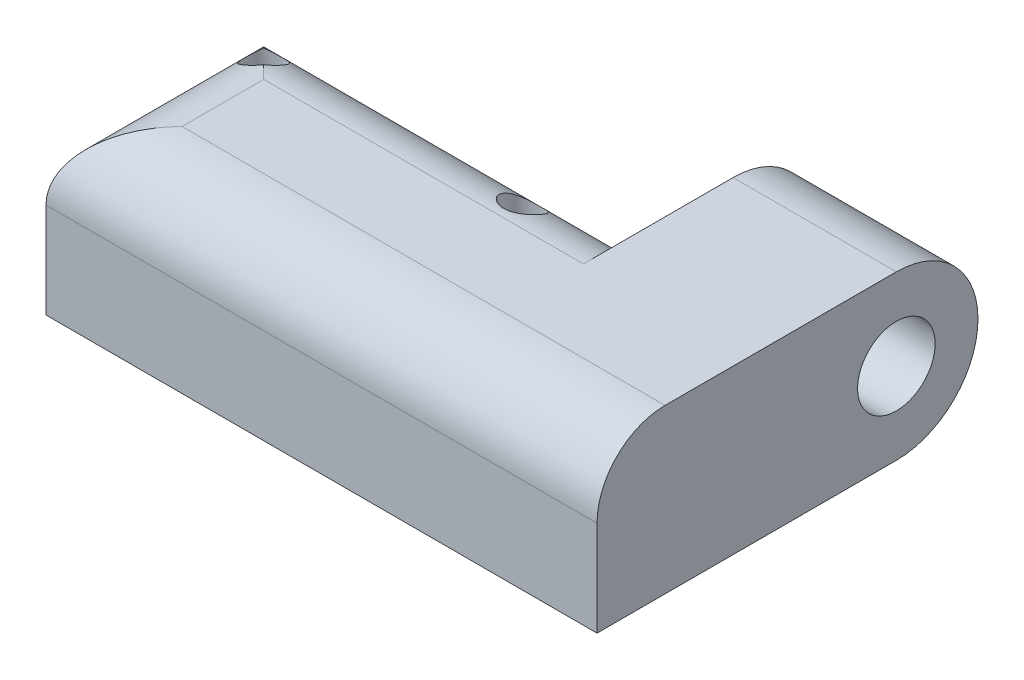
ISO-10303-21;
HEADER;
FILE_DESCRIPTION(('STEP AP214'),'2;1');
FILE_NAME('part.step','',(''),(''),'','','');
FILE_SCHEMA(('AUTOMOTIVE_DESIGN { 1 0 10303 214 1 1 1 1 }'));
ENDSEC;
DATA;
#1=APPLICATION_CONTEXT('core data for automotive mechanical design processes');
#2=APPLICATION_PROTOCOL_DEFINITION('international standard','automotive_design',2000,#1);
#3=PRODUCT_CONTEXT('',#1,'mechanical');
#4=PRODUCT('Part','Part','',(#3));
#5=PRODUCT_RELATED_PRODUCT_CATEGORY('part','',(#4));
#6=PRODUCT_DEFINITION_FORMATION('','',#4);
#7=PRODUCT_DEFINITION_CONTEXT('part definition',#1,'design');
#8=PRODUCT_DEFINITION('design','',#6,#7);
#9=PRODUCT_DEFINITION_SHAPE('','',#8);
#10=(LENGTH_UNIT() NAMED_UNIT(*) SI_UNIT(.MILLI.,.METRE.));
#11=(NAMED_UNIT(*) PLANE_ANGLE_UNIT() SI_UNIT($,.RADIAN.));
#12=(NAMED_UNIT(*) SI_UNIT($,.STERADIAN.) SOLID_ANGLE_UNIT());
#13=UNCERTAINTY_MEASURE_WITH_UNIT(LENGTH_MEASURE(1.E-05),#10,'distance_accuracy_value','');
#14=(GEOMETRIC_REPRESENTATION_CONTEXT(3) GLOBAL_UNCERTAINTY_ASSIGNED_CONTEXT((#13)) GLOBAL_UNIT_ASSIGNED_CONTEXT((#10,
#11,#12)) REPRESENTATION_CONTEXT('',''));
#15=CARTESIAN_POINT('',(0.,0.,0.));
#16=DIRECTION('',(0.,0.,1.));
#17=DIRECTION('',(1.,0.,0.));
#18=AXIS2_PLACEMENT_3D('',#15,#16,#17);
#19=CARTESIAN_POINT('',(1.75,12.,-5.));
#20=DIRECTION('',(0.,-1.,0.));
#21=DIRECTION('',(0.,0.,-1.));
#22=AXIS2_PLACEMENT_3D('',#19,#20,#21);
#23=CYLINDRICAL_SURFACE('',#22,3.);
#24=CARTESIAN_POINT('',(1.75,2.,-5.));
#25=DIRECTION('',(0.,1.,0.));
#26=DIRECTION('',(0.,0.,1.));
#27=AXIS2_PLACEMENT_3D('',#24,#25,#26);
#28=CIRCLE('',#27,3.);
#29=CARTESIAN_POINT('',(-1.07842712474619,2.,-6.));
#30=VERTEX_POINT('',#29);
#31=CARTESIAN_POINT('',(4.57842712474619,2.,-6.));
#32=VERTEX_POINT('',#31);
#33=EDGE_CURVE('E193',#30,#32,#28,.T.);
#34=ORIENTED_EDGE('',*,*,#33,.F.);
#35=DIRECTION('',(0.,-1.,0.));
#36=VECTOR('',#35,1.);
#37=CARTESIAN_POINT('',(-1.07842712474619,12.,-6.));
#38=LINE('',#37,#36);
#39=CARTESIAN_POINT('',(-1.07842712474619,0.,-6.));
#40=VERTEX_POINT('',#39);
#41=EDGE_CURVE('E260',#30,#40,#38,.T.);
#42=ORIENTED_EDGE('',*,*,#41,.T.);
#43=CARTESIAN_POINT('',(1.75,0.,-5.));
#44=DIRECTION('',(0.,1.,0.));
#45=DIRECTION('',(0.,0.,1.));
#46=AXIS2_PLACEMENT_3D('',#43,#44,#45);
#47=CIRCLE('',#46,3.);
#48=CARTESIAN_POINT('',(4.57842712474619,0.,-6.));
#49=VERTEX_POINT('',#48);
#50=EDGE_CURVE('E214',#40,#49,#47,.T.);
#51=ORIENTED_EDGE('',*,*,#50,.T.);
#52=DIRECTION('',(0.,-1.,0.));
#53=VECTOR('',#52,1.);
#54=CARTESIAN_POINT('',(4.57842712474619,12.,-6.));
#55=LINE('',#54,#53);
#56=EDGE_CURVE('E255',#32,#49,#55,.T.);
#57=ORIENTED_EDGE('',*,*,#56,.F.);
#58=EDGE_LOOP('',(#34,#42,#51,#57));
#59=FACE_BOUND('',#58,.T.);
#60=ADVANCED_FACE('F35',(#59),#23,.T.);
#61=CARTESIAN_POINT('',(0.,12.,-6.));
#62=DIRECTION('',(0.,0.,-1.));
#63=DIRECTION('',(-1.,0.,0.));
#64=AXIS2_PLACEMENT_3D('',#61,#62,#63);
#65=PLANE('',#64);
#66=DIRECTION('',(1.,0.,0.));
#67=VECTOR('',#66,1.);
#68=CARTESIAN_POINT('',(0.,2.,-6.));
#69=LINE('',#68,#67);
#70=CARTESIAN_POINT('',(18.25,2.,-6.));
#71=VERTEX_POINT('',#70);
#72=EDGE_CURVE('E201',#32,#71,#69,.T.);
#73=ORIENTED_EDGE('',*,*,#72,.F.);
#74=ORIENTED_EDGE('',*,*,#56,.T.);
#75=DIRECTION('',(1.,0.,0.));
#76=VECTOR('',#75,1.);
#77=CARTESIAN_POINT('',(0.,0.,-6.));
#78=LINE('',#77,#76);
#79=CARTESIAN_POINT('',(18.25,0.,-6.));
#80=VERTEX_POINT('',#79);
#81=EDGE_CURVE('E217',#49,#80,#78,.T.);
#82=ORIENTED_EDGE('',*,*,#81,.T.);
#83=DIRECTION('',(0.,-1.,0.));
#84=VECTOR('',#83,1.);
#85=CARTESIAN_POINT('',(18.25,12.,-6.));
#86=LINE('',#85,#84);
#87=EDGE_CURVE('E270',#71,#80,#86,.T.);
#88=ORIENTED_EDGE('',*,*,#87,.F.);
#89=EDGE_LOOP('',(#73,#74,#82,#88));
#90=FACE_BOUND('',#89,.T.);
#91=ADVANCED_FACE('F314',(#90),#65,.F.);
#92=CARTESIAN_POINT('',(18.25,12.,0.));
#93=DIRECTION('',(-1.,0.,0.));
#94=DIRECTION('',(0.,0.,1.));
#95=AXIS2_PLACEMENT_3D('',#92,#93,#94);
#96=PLANE('',#95);
#97=DIRECTION('',(0.,-1.,0.));
#98=VECTOR('',#97,1.);
#99=CARTESIAN_POINT('',(18.25,12.,6.));
#100=LINE('',#99,#98);
#101=CARTESIAN_POINT('',(18.25,2.,6.));
#102=VERTEX_POINT('',#101);
#103=CARTESIAN_POINT('',(18.25,0.,6.));
#104=VERTEX_POINT('',#103);
#105=EDGE_CURVE('E268',#102,#104,#100,.T.);
#106=ORIENTED_EDGE('',*,*,#105,.F.);
#107=DIRECTION('',(0.,0.,-1.));
#108=VECTOR('',#107,1.);
#109=CARTESIAN_POINT('',(18.25,2.,0.));
#110=LINE('',#109,#108);
#111=EDGE_CURVE('E209',#102,#71,#110,.T.);
#112=ORIENTED_EDGE('',*,*,#111,.T.);
#113=ORIENTED_EDGE('',*,*,#87,.T.);
#114=DIRECTION('',(0.,0.,-1.));
#115=VECTOR('',#114,1.);
#116=CARTESIAN_POINT('',(18.25,0.,0.));
#117=LINE('',#116,#115);
#118=EDGE_CURVE('E220',#104,#80,#117,.T.);
#119=ORIENTED_EDGE('',*,*,#118,.F.);
#120=EDGE_LOOP('',(#106,#112,#113,#119));
#121=FACE_BOUND('',#120,.T.);
#122=ADVANCED_FACE('F318',(#121),#96,.T.);
#123=CARTESIAN_POINT('',(0.,12.,6.));
#124=DIRECTION('',(0.,0.,-1.));
#125=DIRECTION('',(-1.,0.,0.));
#126=AXIS2_PLACEMENT_3D('',#123,#124,#125);
#127=PLANE('',#126);
#128=DIRECTION('',(0.,-1.,0.));
#129=VECTOR('',#128,1.);
#130=CARTESIAN_POINT('',(-18.25,12.,6.));
#131=LINE('',#130,#129);
#132=CARTESIAN_POINT('',(-18.25,2.,6.));
#133=VERTEX_POINT('',#132);
#134=CARTESIAN_POINT('',(-18.25,0.,6.));
#135=VERTEX_POINT('',#134);
#136=EDGE_CURVE('E266',#133,#135,#131,.T.);
#137=ORIENTED_EDGE('',*,*,#136,.F.);
#138=DIRECTION('',(1.,0.,0.));
#139=VECTOR('',#138,1.);
#140=CARTESIAN_POINT('',(0.,2.,6.));
#141=LINE('',#140,#139);
#142=EDGE_CURVE('E207',#133,#102,#141,.T.);
#143=ORIENTED_EDGE('',*,*,#142,.T.);
#144=ORIENTED_EDGE('',*,*,#105,.T.);
#145=DIRECTION('',(1.,0.,0.));
#146=VECTOR('',#145,1.);
#147=CARTESIAN_POINT('',(0.,0.,6.));
#148=LINE('',#147,#146);
#149=EDGE_CURVE('E223',#135,#104,#148,.T.);
#150=ORIENTED_EDGE('',*,*,#149,.F.);
#151=EDGE_LOOP('',(#137,#143,#144,#150));
#152=FACE_BOUND('',#151,.T.);
#153=ADVANCED_FACE('F322',(#152),#127,.T.);
#154=CARTESIAN_POINT('',(-18.25,12.,0.));
#155=DIRECTION('',(-1.,0.,0.));
#156=DIRECTION('',(0.,0.,1.));
#157=AXIS2_PLACEMENT_3D('',#154,#155,#156);
#158=PLANE('',#157);
#159=DIRECTION('',(0.,0.,-1.));
#160=VECTOR('',#159,1.);
#161=CARTESIAN_POINT('',(-18.25,2.,0.));
#162=LINE('',#161,#160);
#163=CARTESIAN_POINT('',(-18.25,2.,-2.17157287525381));
#164=VERTEX_POINT('',#163);
#165=EDGE_CURVE('E204',#133,#164,#162,.T.);
#166=ORIENTED_EDGE('',*,*,#165,.F.);
#167=ORIENTED_EDGE('',*,*,#136,.T.);
#168=DIRECTION('',(0.,0.,-1.));
#169=VECTOR('',#168,1.);
#170=CARTESIAN_POINT('',(-18.25,0.,0.));
#171=LINE('',#170,#169);
#172=CARTESIAN_POINT('',(-18.25,0.,-2.17157287525381));
#173=VERTEX_POINT('',#172);
#174=EDGE_CURVE('E226',#135,#173,#171,.T.);
#175=ORIENTED_EDGE('',*,*,#174,.T.);
#176=DIRECTION('',(0.,-1.,0.));
#177=VECTOR('',#176,1.);
#178=CARTESIAN_POINT('',(-18.25,12.,-2.17157287525381));
#179=LINE('',#178,#177);
#180=EDGE_CURVE('E264',#164,#173,#179,.T.);
#181=ORIENTED_EDGE('',*,*,#180,.F.);
#182=EDGE_LOOP('',(#166,#167,#175,#181));
#183=FACE_BOUND('',#182,.T.);
#184=ADVANCED_FACE('F326',(#183),#158,.F.);
#185=CARTESIAN_POINT('',(-17.25,12.,-5.));
#186=DIRECTION('',(0.,-1.,0.));
#187=DIRECTION('',(0.,0.,-1.));
#188=AXIS2_PLACEMENT_3D('',#185,#186,#187);
#189=CYLINDRICAL_SURFACE('',#188,3.);
#190=CARTESIAN_POINT('',(-17.25,2.,-5.));
#191=DIRECTION('',(0.,1.,0.));
#192=DIRECTION('',(0.,0.,1.));
#193=AXIS2_PLACEMENT_3D('',#190,#191,#192);
#194=CIRCLE('',#193,3.);
#195=CARTESIAN_POINT('',(-14.4215728752538,2.,-6.));
#196=VERTEX_POINT('',#195);
#197=EDGE_CURVE('E200',#164,#196,#194,.T.);
#198=ORIENTED_EDGE('',*,*,#197,.F.);
#199=ORIENTED_EDGE('',*,*,#180,.T.);
#200=CARTESIAN_POINT('',(-17.25,0.,-5.));
#201=DIRECTION('',(0.,1.,0.));
#202=DIRECTION('',(0.,0.,1.));
#203=AXIS2_PLACEMENT_3D('',#200,#201,#202);
#204=CIRCLE('',#203,3.);
#205=CARTESIAN_POINT('',(-14.4215728752538,0.,-6.));
#206=VERTEX_POINT('',#205);
#207=EDGE_CURVE('E229',#173,#206,#204,.T.);
#208=ORIENTED_EDGE('',*,*,#207,.T.);
#209=DIRECTION('',(0.,-1.,0.));
#210=VECTOR('',#209,1.);
#211=CARTESIAN_POINT('',(-14.4215728752538,12.,-6.));
#212=LINE('',#211,#210);
#213=EDGE_CURVE('E262',#196,#206,#212,.T.);
#214=ORIENTED_EDGE('',*,*,#213,.F.);
#215=EDGE_LOOP('',(#198,#199,#208,#214));
#216=FACE_BOUND('',#215,.T.);
#217=ADVANCED_FACE('F330',(#216),#189,.T.);
#218=CARTESIAN_POINT('',(0.,12.,-6.));
#219=DIRECTION('',(0.,0.,-1.));
#220=DIRECTION('',(-1.,0.,0.));
#221=AXIS2_PLACEMENT_3D('',#218,#219,#220);
#222=PLANE('',#221);
#223=EDGE_CURVE('E197',#196,#30,#69,.T.);
#224=ORIENTED_EDGE('',*,*,#223,.F.);
#225=ORIENTED_EDGE('',*,*,#213,.T.);
#226=DIRECTION('',(1.,0.,0.));
#227=VECTOR('',#226,1.);
#228=CARTESIAN_POINT('',(0.,0.,-6.));
#229=LINE('',#228,#227);
#230=EDGE_CURVE('E232',#206,#40,#229,.T.);
#231=ORIENTED_EDGE('',*,*,#230,.T.);
#232=ORIENTED_EDGE('',*,*,#41,.F.);
#233=EDGE_LOOP('',(#224,#225,#231,#232));
#234=FACE_BOUND('',#233,.T.);
#235=ADVANCED_FACE('F334',(#234),#222,.F.);
#236=CARTESIAN_POINT('',(0.,12.,-8.));
#237=DIRECTION('',(0.,0.,-1.));
#238=DIRECTION('',(-1.,0.,0.));
#239=AXIS2_PLACEMENT_3D('',#236,#237,#238);
#240=PLANE('',#239);
#241=DIRECTION('',(0.,-1.,0.));
#242=VECTOR('',#241,1.);
#243=CARTESIAN_POINT('',(-20.25,12.,-8.));
#244=LINE('',#243,#242);
#245=CARTESIAN_POINT('',(-20.25,7.,-8.));
#246=VERTEX_POINT('',#245);
#247=CARTESIAN_POINT('',(-20.25,0.,-8.));
#248=VERTEX_POINT('',#247);
#249=EDGE_CURVE('E257',#246,#248,#244,.T.);
#250=ORIENTED_EDGE('',*,*,#249,.F.);
#251=DIRECTION('',(1.,0.,0.));
#252=VECTOR('',#251,1.);
#253=CARTESIAN_POINT('',(0.,7.,-8.));
#254=LINE('',#253,#252);
#255=CARTESIAN_POINT('',(8.25,7.,-8.));
#256=VERTEX_POINT('',#255);
#257=EDGE_CURVE('E281',#246,#256,#254,.T.);
#258=ORIENTED_EDGE('',*,*,#257,.T.);
#259=DIRECTION('',(0.,1.,0.));
#260=VECTOR('',#259,1.);
#261=CARTESIAN_POINT('',(8.25,0.,-8.));
#262=LINE('',#261,#260);
#263=CARTESIAN_POINT('',(8.25,0.,-8.));
#264=VERTEX_POINT('',#263);
#265=EDGE_CURVE('E164',#264,#256,#262,.T.);
#266=ORIENTED_EDGE('',*,*,#265,.F.);
#267=DIRECTION('',(1.,0.,0.));
#268=VECTOR('',#267,1.);
#269=CARTESIAN_POINT('',(0.,0.,-8.));
#270=LINE('',#269,#268);
#271=EDGE_CURVE('E238',#248,#264,#270,.T.);
#272=ORIENTED_EDGE('',*,*,#271,.F.);
#273=EDGE_LOOP('',(#250,#258,#266,#272));
#274=FACE_BOUND('',#273,.T.);
#275=ADVANCED_FACE('F337',(#274),#240,.T.);
#276=CARTESIAN_POINT('',(-20.25,12.,0.));
#277=DIRECTION('',(-1.,0.,0.));
#278=DIRECTION('',(0.,0.,1.));
#279=AXIS2_PLACEMENT_3D('',#276,#277,#278);
#280=PLANE('',#279);
#281=DIRECTION('',(0.,-1.,0.));
#282=VECTOR('',#281,1.);
#283=CARTESIAN_POINT('',(-20.25,12.,8.));
#284=LINE('',#283,#282);
#285=CARTESIAN_POINT('',(-20.25,7.,8.));
#286=VERTEX_POINT('',#285);
#287=CARTESIAN_POINT('',(-20.25,0.,8.));
#288=VERTEX_POINT('',#287);
#289=EDGE_CURVE('E254',#286,#288,#284,.T.);
#290=ORIENTED_EDGE('',*,*,#289,.F.);
#291=DIRECTION('',(0.,0.,-1.));
#292=VECTOR('',#291,1.);
#293=CARTESIAN_POINT('',(-20.25,7.,0.));
#294=LINE('',#293,#292);
#295=EDGE_CURVE('E259',#286,#246,#294,.T.);
#296=ORIENTED_EDGE('',*,*,#295,.T.);
#297=ORIENTED_EDGE('',*,*,#249,.T.);
#298=DIRECTION('',(0.,0.,-1.));
#299=VECTOR('',#298,1.);
#300=CARTESIAN_POINT('',(-20.25,0.,0.));
#301=LINE('',#300,#299);
#302=EDGE_CURVE('E241',#288,#248,#301,.T.);
#303=ORIENTED_EDGE('',*,*,#302,.F.);
#304=EDGE_LOOP('',(#290,#296,#297,#303));
#305=FACE_BOUND('',#304,.T.);
#306=ADVANCED_FACE('F347',(#305),#280,.T.);
#307=CARTESIAN_POINT('',(0.,12.,8.));
#308=DIRECTION('',(0.,0.,-1.));
#309=DIRECTION('',(-1.,0.,0.));
#310=AXIS2_PLACEMENT_3D('',#307,#308,#309);
#311=PLANE('',#310);
#312=DIRECTION('',(0.,-1.,0.));
#313=VECTOR('',#312,1.);
#314=CARTESIAN_POINT('',(20.25,12.,8.));
#315=LINE('',#314,#313);
#316=CARTESIAN_POINT('',(20.25,7.,8.));
#317=VERTEX_POINT('',#316);
#318=CARTESIAN_POINT('',(20.25,0.,8.));
#319=VERTEX_POINT('',#318);
#320=EDGE_CURVE('E252',#317,#319,#315,.T.);
#321=ORIENTED_EDGE('',*,*,#320,.F.);
#322=DIRECTION('',(1.,0.,0.));
#323=VECTOR('',#322,1.);
#324=CARTESIAN_POINT('',(-20.25,7.,8.));
#325=LINE('',#324,#323);
#326=EDGE_CURVE('E285',#317,#286,#325,.F.);
#327=ORIENTED_EDGE('',*,*,#326,.T.);
#328=ORIENTED_EDGE('',*,*,#289,.T.);
#329=DIRECTION('',(1.,0.,0.));
#330=VECTOR('',#329,1.);
#331=CARTESIAN_POINT('',(0.,0.,8.));
#332=LINE('',#331,#330);
#333=EDGE_CURVE('E244',#288,#319,#332,.T.);
#334=ORIENTED_EDGE('',*,*,#333,.T.);
#335=EDGE_LOOP('',(#321,#327,#328,#334));
#336=FACE_BOUND('',#335,.T.);
#337=ADVANCED_FACE('F351',(#336),#311,.F.);
#338=CARTESIAN_POINT('',(20.25,12.,0.));
#339=DIRECTION('',(-1.,0.,0.));
#340=DIRECTION('',(0.,0.,1.));
#341=AXIS2_PLACEMENT_3D('',#338,#339,#340);
#342=PLANE('',#341);
#343=DIRECTION('',(0.,0.,-1.));
#344=VECTOR('',#343,1.);
#345=CARTESIAN_POINT('',(20.25,12.,0.));
#346=LINE('',#345,#344);
#347=CARTESIAN_POINT('',(20.25,12.,3.));
#348=VERTEX_POINT('',#347);
#349=CARTESIAN_POINT('',(20.25,12.,-8.));
#350=VERTEX_POINT('',#349);
#351=EDGE_CURVE('E211',#348,#350,#346,.T.);
#352=ORIENTED_EDGE('',*,*,#351,.F.);
#353=CARTESIAN_POINT('',(20.25,7.,3.));
#354=DIRECTION('',(-1.,0.,0.));
#355=DIRECTION('',(0.,0.,1.));
#356=AXIS2_PLACEMENT_3D('',#353,#354,#355);
#357=CIRCLE('',#356,5.);
#358=EDGE_CURVE('E283',#348,#317,#357,.F.);
#359=ORIENTED_EDGE('',*,*,#358,.T.);
#360=ORIENTED_EDGE('',*,*,#320,.T.);
#361=DIRECTION('',(0.,0.,-1.));
#362=VECTOR('',#361,1.);
#363=CARTESIAN_POINT('',(20.25,0.,0.));
#364=LINE('',#363,#362);
#365=CARTESIAN_POINT('',(20.25,0.,-14.));
#366=VERTEX_POINT('',#365);
#367=EDGE_CURVE('E247',#319,#366,#364,.T.);
#368=ORIENTED_EDGE('',*,*,#367,.T.);
#369=CARTESIAN_POINT('',(20.25,6.00000025026065,-14.));
#370=DIRECTION('',(1.,0.,0.));
#371=DIRECTION('',(0.,0.,-1.));
#372=AXIS2_PLACEMENT_3D('',#369,#370,#371);
#373=CIRCLE('',#372,6.00000025026066);
#374=CARTESIAN_POINT('',(20.25,12.0000005005213,-13.9999994994787));
#375=VERTEX_POINT('',#374);
#376=EDGE_CURVE('E189',#375,#366,#373,.F.);
#377=ORIENTED_EDGE('',*,*,#376,.F.);
#378=DIRECTION('',(0.,8.342022503018E-08,-0.999999999999997));
#379=VECTOR('',#378,1.);
#380=CARTESIAN_POINT('',(20.25,11.9999993326381,1.00104264469069E-06));
#381=LINE('',#380,#379);
#382=EDGE_CURVE('E170',#350,#375,#381,.T.);
#383=ORIENTED_EDGE('',*,*,#382,.F.);
#384=EDGE_LOOP('',(#352,#359,#360,#368,#377,#383));
#385=FACE_BOUND('',#384,.T.);
#386=CARTESIAN_POINT('',(20.25,6.00000050052131,-14.));
#387=DIRECTION('',(1.,0.,0.));
#388=DIRECTION('',(0.,0.,-1.));
#389=AXIS2_PLACEMENT_3D('',#386,#387,#388);
#390=CIRCLE('',#389,2.85);
#391=CARTESIAN_POINT('',(20.25,6.00000050052131,-16.85));
#392=VERTEX_POINT('',#391);
#393=EDGE_CURVE('E179',#392,#392,#390,.T.);
#394=ORIENTED_EDGE('',*,*,#393,.F.);
#395=EDGE_LOOP('',(#394));
#396=FACE_BOUND('',#395,.T.);
#397=ADVANCED_FACE('F343',(#385,#396),#342,.F.);
#398=CARTESIAN_POINT('',(1.75,12.,-5.));
#399=DIRECTION('',(0.,-1.,0.));
#400=DIRECTION('',(0.,0.,-1.));
#401=AXIS2_PLACEMENT_3D('',#398,#399,#400);
#402=CYLINDRICAL_SURFACE('',#401,1.35);
#403=CARTESIAN_POINT('',(1.75,10.7118054905935,-6.35));
#404=CARTESIAN_POINT('',(1.68633346264365,10.7118069505357,-6.3499988649285));
#405=CARTESIAN_POINT('',(1.622659743009,10.7159165445857,-6.34546174054275));
#406=CARTESIAN_POINT('',(1.49752776474204,10.731837492649,-6.32769042226945));
#407=CARTESIAN_POINT('',(1.43607137833605,10.7436552015744,-6.31444905214481));
#408=CARTESIAN_POINT('',(1.31752789829524,10.7735829658311,-6.28033149643431));
#409=CARTESIAN_POINT('',(1.26041139027443,10.7916449730188,-6.25951354781143));
#410=CARTESIAN_POINT('',(1.15091655894143,10.8325863391145,-6.21127441868484));
#411=CARTESIAN_POINT('',(1.09854162397885,10.8554691047092,-6.18384856659264));
#412=CARTESIAN_POINT('',(0.979185288418504,10.9144358587471,-6.11129296304661));
#413=CARTESIAN_POINT('',(0.914654331510719,10.9521552243272,-6.0634564876951));
#414=CARTESIAN_POINT('',(0.796145166665005,11.0312456348678,-5.95861215703887));
#415=CARTESIAN_POINT('',(0.742181488180274,11.0726215956506,-5.90159186795738));
#416=CARTESIAN_POINT('',(0.644594713912174,11.1572766356932,-5.77896936791173));
#417=CARTESIAN_POINT('',(0.601115925431546,11.2005735162996,-5.71326476940445));
#418=CARTESIAN_POINT('',(0.526089057770143,11.2866735131792,-5.57508448792313));
#419=CARTESIAN_POINT('',(0.494539959243283,11.3294766713359,-5.50260938412294));
#420=CARTESIAN_POINT('',(0.441921975274486,11.4170306903281,-5.34493368043535));
#421=CARTESIAN_POINT('',(0.422145863691863,11.4615756030002,-5.25917907402492));
#422=CARTESIAN_POINT('',(0.399668953027275,11.5463357491173,-5.08334704414863));
#423=CARTESIAN_POINT('',(0.396961899081843,11.5865525632597,-4.99327121636433));
#424=CARTESIAN_POINT('',(0.409542347125937,11.6581459561617,-4.81928823750181));
#425=CARTESIAN_POINT('',(0.423402945873035,11.6899730021885,-4.73546627330128));
#426=CARTESIAN_POINT('',(0.467415320481503,11.7478715831384,-4.57014858899842));
#427=CARTESIAN_POINT('',(0.497552112736919,11.7739483806039,-4.48865080182951));
#428=CARTESIAN_POINT('',(0.569390817357094,11.8174355852659,-4.34073716457875));
#429=CARTESIAN_POINT('',(0.609356615640022,11.8354988482792,-4.2736662107891));
#430=CARTESIAN_POINT('',(0.700892881126025,11.8671525462276,-4.14677918791465));
#431=CARTESIAN_POINT('',(0.752459646024893,11.8807444047556,-4.0869608136116));
#432=CARTESIAN_POINT('',(0.862412857060867,11.9032902136972,-3.9800843316237));
#433=CARTESIAN_POINT('',(0.920232902466041,11.9124668142205,-3.93248854845743));
#434=CARTESIAN_POINT('',(1.043215400822,11.9278628640397,-3.84737431983957));
#435=CARTESIAN_POINT('',(1.10837733448778,11.9340825223152,-3.80985516231186));
#436=CARTESIAN_POINT('',(1.24369590498989,11.9440908416172,-3.74632315778729));
#437=CARTESIAN_POINT('',(1.31381453898374,11.9478961541225,-3.72023188961543));
#438=CARTESIAN_POINT('',(1.45746875979677,11.9535909256982,-3.67996581609734));
#439=CARTESIAN_POINT('',(1.53100444954897,11.9554803270157,-3.66579136997111));
#440=CARTESIAN_POINT('',(1.67986725054844,11.9576116983878,-3.64973381762584));
#441=CARTESIAN_POINT('',(1.75520234738719,11.9578439261531,-3.64792340045458));
#442=CARTESIAN_POINT('',(1.90511551318996,11.9566702544578,-3.65684039772837));
#443=CARTESIAN_POINT('',(1.97969356483748,11.955264317611,-3.66756809831915));
#444=CARTESIAN_POINT('',(2.12613185405525,11.9506058011485,-3.70127710120324));
#445=CARTESIAN_POINT('',(2.19798615662134,11.9473494113512,-3.72428368040477));
#446=CARTESIAN_POINT('',(2.33675375636561,11.9385763207168,-3.78186120902291));
#447=CARTESIAN_POINT('',(2.40366722214188,11.9330596970486,-3.81643176361473));
#448=CARTESIAN_POINT('',(2.53039747594845,11.9192468538435,-3.89589288355094));
#449=CARTESIAN_POINT('',(2.59023922033847,11.910960829834,-3.94074540836879));
#450=CARTESIAN_POINT('',(2.70141246597007,11.8910385814619,-4.03935750634027));
#451=CARTESIAN_POINT('',(2.75274486832895,11.8794027121968,-4.09311613515352));
#452=CARTESIAN_POINT('',(2.84530372994186,11.8523778896476,-4.20741564768018));
#453=CARTESIAN_POINT('',(2.88658095863345,11.8370086078531,-4.26792011162649));
#454=CARTESIAN_POINT('',(2.95846399811624,11.8022232470687,-4.39388552605635));
#455=CARTESIAN_POINT('',(2.98906976327295,11.7828071507738,-4.459346497734));
#456=CARTESIAN_POINT('',(3.03957643482844,11.7396095838754,-4.59410736952344));
#457=CARTESIAN_POINT('',(3.0593102346962,11.7157671160803,-4.66345006788702));
#458=CARTESIAN_POINT('',(3.08744189306798,11.6642064207299,-4.80297409134829));
#459=CARTESIAN_POINT('',(3.09583667186468,11.6364871424779,-4.87315563906016));
#460=CARTESIAN_POINT('',(3.10193084630847,11.575834307343,-5.01698011447213));
#461=CARTESIAN_POINT('',(3.09891679376698,11.5426813512796,-5.09055964551363));
#462=CARTESIAN_POINT('',(3.08139682888107,11.4734412370611,-5.23489217824932));
#463=CARTESIAN_POINT('',(3.06688725021872,11.4373531460864,-5.30564427061272));
#464=CARTESIAN_POINT('',(3.02508158692069,11.3591880123376,-5.4505027501749));
#465=CARTESIAN_POINT('',(2.99656567590436,11.3168866418036,-5.52413604713858));
#466=CARTESIAN_POINT('',(2.9274598280922,11.2313660135377,-5.6650234778556));
#467=CARTESIAN_POINT('',(2.88685513196657,11.1881456940965,-5.73226968038674));
#468=CARTESIAN_POINT('',(2.78995686294728,11.0985701598416,-5.86508597815642));
#469=CARTESIAN_POINT('',(2.7325483328243,11.0523015324159,-5.92990613224138));
#470=CARTESIAN_POINT('',(2.60473665705698,10.9637931839324,-6.04857407113067));
#471=CARTESIAN_POINT('',(2.53435301395755,10.9215475586492,-6.10243807159568));
#472=CARTESIAN_POINT('',(2.40451354309389,10.8567136269894,-6.18238312820205));
#473=CARTESIAN_POINT('',(2.34822563368192,10.8320509114557,-6.21193457048618));
#474=CARTESIAN_POINT('',(2.23021038684107,10.7883717295317,-6.26333830182781));
#475=CARTESIAN_POINT('',(2.16849177021693,10.7693464175228,-6.28520266280691));
#476=CARTESIAN_POINT('',(2.04788838642814,10.7404630202754,-6.31803648642465));
#477=CARTESIAN_POINT('',(1.98945210949608,10.7298205980713,-6.32994734092918));
#478=CARTESIAN_POINT('',(1.87067864979135,10.7154930895045,-6.3459274398678));
#479=CARTESIAN_POINT('',(1.81034255084175,10.7118041068739,-6.35000107581019));
#480=CARTESIAN_POINT('',(1.75,10.7118054905935,-6.35));
#481=B_SPLINE_CURVE_WITH_KNOTS('',3,(#403,#404,#405,#406,#407,#408,#409,#410,#411,#412,#413,
#414,#415,#416,#417,#418,#419,#420,#421,#422,#423,#424,#425,#426,#427,#428,#429,#430,#431,#432,
#433,#434,#435,#436,#437,#438,#439,#440,#441,#442,#443,#444,#445,#446,#447,#448,#449,#450,#451,
#452,#453,#454,#455,#456,#457,#458,#459,#460,#461,#462,#463,#464,#465,#466,#467,#468,#469,#470,
#471,#472,#473,#474,#475,#476,#477,#478,#479,#480),.UNSPECIFIED.,.T.,.F.,(4,2,2,2,2,2,2,2,2,2,2,
2,2,2,2,2,2,2,2,2,2,2,2,2,2,2,2,2,2,2,2,2,2,2,2,2,2,2,4),(0.,0.190736269587081,
0.381629989726671,0.571086377499543,0.760677100280385,1.02549631893232,1.29067713220059,
1.5593224493282,1.82794480655771,2.12228855683808,2.41652444017832,2.68714330734036,
2.95751347065409,3.19668054147784,3.43577139310996,3.66104378789719,3.88630025936525,
4.10998577225636,4.33367802766876,4.55868426295002,4.78369563343852,5.00917200194223,
5.23464067286996,5.4592882615891,5.68391204549218,5.90737701632553,6.13084294275294,
6.35765407748783,6.5845268023322,6.82581446147558,7.0671791065311,7.33481452262194,
7.6027780471529,7.89589642965934,8.18857777378515,8.39241823006646,8.59593712678641,
8.7768165693307,8.95759462830544),.UNSPECIFIED.);
#482=CARTESIAN_POINT('',(1.75,10.7118054905935,-6.35));
#483=VERTEX_POINT('',#482);
#484=EDGE_CURVE('E39',#483,#483,#481,.T.);
#485=ORIENTED_EDGE('',*,*,#484,.T.);
#486=EDGE_LOOP('',(#485));
#487=FACE_BOUND('',#486,.T.);
#488=CARTESIAN_POINT('',(1.75,0.,-5.));
#489=DIRECTION('',(0.,1.,0.));
#490=DIRECTION('',(0.,0.,1.));
#491=AXIS2_PLACEMENT_3D('',#488,#489,#490);
#492=CIRCLE('',#491,1.35);
#493=CARTESIAN_POINT('',(1.75,0.,-3.65));
#494=VERTEX_POINT('',#493);
#495=EDGE_CURVE('E235',#494,#494,#492,.T.);
#496=ORIENTED_EDGE('',*,*,#495,.F.);
#497=EDGE_LOOP('',(#496));
#498=FACE_BOUND('',#497,.T.);
#499=ADVANCED_FACE('F339',(#487,#498),#402,.F.);
#500=CARTESIAN_POINT('',(-17.25,12.,-5.));
#501=DIRECTION('',(0.,-1.,0.));
#502=DIRECTION('',(0.,0.,-1.));
#503=AXIS2_PLACEMENT_3D('',#500,#501,#502);
#504=CYLINDRICAL_SURFACE('',#503,1.35);
#505=CARTESIAN_POINT('',(-17.25,10.7118054905935,-6.35));
#506=CARTESIAN_POINT('',(-17.3136665373563,10.7118069505357,-6.3499988649285));
#507=CARTESIAN_POINT('',(-17.377340256991,10.7159165445857,-6.34546174054275));
#508=CARTESIAN_POINT('',(-17.502472235258,10.731837492649,-6.32769042226945));
#509=CARTESIAN_POINT('',(-17.563928621664,10.7436552015744,-6.31444905214481));
#510=CARTESIAN_POINT('',(-17.6824721017048,10.7735829658311,-6.28033149643431));
#511=CARTESIAN_POINT('',(-17.7395886097256,10.7916449730188,-6.25951354781143));
#512=CARTESIAN_POINT('',(-17.8490834410586,10.8325863391145,-6.21127441868484));
#513=CARTESIAN_POINT('',(-17.9014583760212,10.8554691047092,-6.18384856659264));
#514=CARTESIAN_POINT('',(-18.0208147115815,10.9144358587471,-6.11129296304661));
#515=CARTESIAN_POINT('',(-18.0853456684893,10.9521552243272,-6.06345648769511));
#516=CARTESIAN_POINT('',(-18.203854833335,11.0312456348678,-5.95861215703887));
#517=CARTESIAN_POINT('',(-18.2578185118197,11.0726215956506,-5.90159186795738));
#518=CARTESIAN_POINT('',(-18.3554052860878,11.1572766356932,-5.77896936791173));
#519=CARTESIAN_POINT('',(-18.3988840745685,11.2005735162996,-5.71326476940444));
#520=CARTESIAN_POINT('',(-18.4739109422299,11.2866735131792,-5.57508448792313));
#521=CARTESIAN_POINT('',(-18.5054600407567,11.3294766713359,-5.50260938412293));
#522=CARTESIAN_POINT('',(-18.5580780247255,11.4170306903281,-5.34493368043534));
#523=CARTESIAN_POINT('',(-18.5778541363081,11.4615756030002,-5.25917907402491));
#524=CARTESIAN_POINT('',(-18.6003310469727,11.5463357491173,-5.08334704414863));
#525=CARTESIAN_POINT('',(-18.6030381009182,11.5865525632597,-4.99327121636432));
#526=CARTESIAN_POINT('',(-18.5904576528741,11.6581459561617,-4.8192882375018));
#527=CARTESIAN_POINT('',(-18.576597054127,11.6899730021885,-4.73546627330128));
#528=CARTESIAN_POINT('',(-18.5325846795185,11.7478715831384,-4.57014858899842));
#529=CARTESIAN_POINT('',(-18.5024478872631,11.7739483806039,-4.48865080182951));
#530=CARTESIAN_POINT('',(-18.4306091826429,11.8174355852659,-4.34073716457874));
#531=CARTESIAN_POINT('',(-18.39064338436,11.8354988482792,-4.2736662107891));
#532=CARTESIAN_POINT('',(-18.299107118874,11.8671525462276,-4.14677918791465));
#533=CARTESIAN_POINT('',(-18.2475403539751,11.8807444047556,-4.08696081361159));
#534=CARTESIAN_POINT('',(-18.1375871429391,11.9032902136972,-3.9800843316237));
#535=CARTESIAN_POINT('',(-18.079767097534,11.9124668142205,-3.93248854845742));
#536=CARTESIAN_POINT('',(-17.956784599178,11.9278628640397,-3.84737431983957));
#537=CARTESIAN_POINT('',(-17.8916226655122,11.9340825223152,-3.80985516231186));
#538=CARTESIAN_POINT('',(-17.7563040950101,11.9440908416172,-3.74632315778729));
#539=CARTESIAN_POINT('',(-17.6861854610163,11.9478961541225,-3.72023188961543));
#540=CARTESIAN_POINT('',(-17.5425312402032,11.9535909256982,-3.67996581609734));
#541=CARTESIAN_POINT('',(-17.468995550451,11.9554803270157,-3.6657913699711));
#542=CARTESIAN_POINT('',(-17.3201327494516,11.9576116983878,-3.64973381762584));
#543=CARTESIAN_POINT('',(-17.2447976526128,11.9578439261531,-3.64792340045458));
#544=CARTESIAN_POINT('',(-17.09488448681,11.9566702544578,-3.65684039772837));
#545=CARTESIAN_POINT('',(-17.0203064351625,11.955264317611,-3.66756809831915));
#546=CARTESIAN_POINT('',(-16.8738681459447,11.9506058011485,-3.70127710120324));
#547=CARTESIAN_POINT('',(-16.8020138433787,11.9473494113512,-3.72428368040477));
#548=CARTESIAN_POINT('',(-16.6632462436344,11.9385763207168,-3.78186120902291));
#549=CARTESIAN_POINT('',(-16.5963327778581,11.9330596970486,-3.81643176361473));
#550=CARTESIAN_POINT('',(-16.4696025240515,11.9192468538435,-3.89589288355094));
#551=CARTESIAN_POINT('',(-16.4097607796615,11.910960829834,-3.94074540836879));
#552=CARTESIAN_POINT('',(-16.2985875340299,11.8910385814619,-4.03935750634027));
#553=CARTESIAN_POINT('',(-16.2472551316711,11.8794027121968,-4.09311613515353));
#554=CARTESIAN_POINT('',(-16.1546962700581,11.8523778896476,-4.20741564768018));
#555=CARTESIAN_POINT('',(-16.1134190413665,11.8370086078531,-4.26792011162649));
#556=CARTESIAN_POINT('',(-16.0415360018838,11.8022232470687,-4.39388552605635));
#557=CARTESIAN_POINT('',(-16.010930236727,11.7828071507738,-4.459346497734));
#558=CARTESIAN_POINT('',(-15.9604235651716,11.7396095838754,-4.59410736952345));
#559=CARTESIAN_POINT('',(-15.9406897653038,11.7157671160803,-4.66345006788703));
#560=CARTESIAN_POINT('',(-15.912558106932,11.6642064207299,-4.80297409134829));
#561=CARTESIAN_POINT('',(-15.9041633281353,11.6364871424779,-4.87315563906017));
#562=CARTESIAN_POINT('',(-15.8980691536915,11.575834307343,-5.01698011447213));
#563=CARTESIAN_POINT('',(-15.901083206233,11.5426813512796,-5.09055964551363));
#564=CARTESIAN_POINT('',(-15.9186031711189,11.4734412370611,-5.23489217824932));
#565=CARTESIAN_POINT('',(-15.9331127497813,11.4373531460864,-5.30564427061272));
#566=CARTESIAN_POINT('',(-15.9749184130793,11.3591880123376,-5.45050275017491));
#567=CARTESIAN_POINT('',(-16.0034343240956,11.3168866418036,-5.52413604713858));
#568=CARTESIAN_POINT('',(-16.0725401719078,11.2313660135377,-5.6650234778556));
#569=CARTESIAN_POINT('',(-16.1131448680334,11.1881456940965,-5.73226968038674));
#570=CARTESIAN_POINT('',(-16.2100431370527,11.0985701598416,-5.86508597815643));
#571=CARTESIAN_POINT('',(-16.2674516671757,11.0523015324159,-5.92990613224138));
#572=CARTESIAN_POINT('',(-16.395263342943,10.9637931839324,-6.04857407113068));
#573=CARTESIAN_POINT('',(-16.4656469860425,10.9215475586492,-6.10243807159569));
#574=CARTESIAN_POINT('',(-16.5954864569061,10.8567136269894,-6.18238312820205));
#575=CARTESIAN_POINT('',(-16.6517743663181,10.8320509114557,-6.21193457048618));
#576=CARTESIAN_POINT('',(-16.7697896131589,10.7883717295317,-6.26333830182781));
#577=CARTESIAN_POINT('',(-16.8315082297831,10.7693464175228,-6.28520266280691));
#578=CARTESIAN_POINT('',(-16.9521116135719,10.7404630202754,-6.31803648642465));
#579=CARTESIAN_POINT('',(-17.0105478905039,10.7298205980713,-6.32994734092919));
#580=CARTESIAN_POINT('',(-17.1293213502087,10.7154930895045,-6.3459274398678));
#581=CARTESIAN_POINT('',(-17.1896574491583,10.7118041068739,-6.3500010758102));
#582=CARTESIAN_POINT('',(-17.25,10.7118054905935,-6.35));
#583=B_SPLINE_CURVE_WITH_KNOTS('',3,(#505,#506,#507,#508,#509,#510,#511,#512,#513,#514,#515,
#516,#517,#518,#519,#520,#521,#522,#523,#524,#525,#526,#527,#528,#529,#530,#531,#532,#533,#534,
#535,#536,#537,#538,#539,#540,#541,#542,#543,#544,#545,#546,#547,#548,#549,#550,#551,#552,#553,
#554,#555,#556,#557,#558,#559,#560,#561,#562,#563,#564,#565,#566,#567,#568,#569,#570,#571,#572,
#573,#574,#575,#576,#577,#578,#579,#580,#581,#582),.UNSPECIFIED.,.T.,.F.,(4,2,2,2,2,2,2,2,2,2,2,
2,2,2,2,2,2,2,2,2,2,2,2,2,2,2,2,2,2,2,2,2,2,2,2,2,2,2,4),(0.,0.190736269587077,0.38162998972667,
0.571086377499542,0.760677100280388,1.02549631893233,1.2906771322006,1.55932244932821,
1.82794480655771,2.12228855683808,2.41652444017833,2.68714330734037,2.9575134706541,
3.19668054147784,3.43577139310997,3.6610437878972,3.88630025936526,4.10998577225638,
4.33367802766877,4.55868426295003,4.78369563343853,5.00917200194224,5.23464067286997,
5.45928826158911,5.68391204549219,5.90737701632554,6.13084294275296,6.35765407748784,
6.58452680233221,6.82581446147559,7.06717910653112,7.33481452262196,7.60277804715292,
7.89589642965935,8.18857777378517,8.39241823006648,8.59593712678642,8.77681656933072,
8.95759462830546),.UNSPECIFIED.);
#584=CARTESIAN_POINT('',(-16.2954058453982,11.8894914478305,-4.04540584539816));
#585=VERTEX_POINT('',#584);
#586=CARTESIAN_POINT('',(-18.2045941546018,11.0336550895674,-5.95459415460184));
#587=VERTEX_POINT('',#586);
#588=EDGE_CURVE('E213',#585,#587,#583,.T.);
#589=ORIENTED_EDGE('',*,*,#588,.T.);
#590=CARTESIAN_POINT('',(-18.2045941546018,11.0336550895674,-5.95459415460184));
#591=CARTESIAN_POINT('',(-18.2544094865166,10.9971672819156,-5.90477927699904));
#592=CARTESIAN_POINT('',(-18.3007434301856,10.961800675363,-5.85066692787128));
#593=CARTESIAN_POINT('',(-18.3852347387497,10.8952772879161,-5.73410418359898));
#594=CARTESIAN_POINT('',(-18.4234026398523,10.8641151017059,-5.67166470353497));
#595=CARTESIAN_POINT('',(-18.4838173611932,10.8136184033538,-5.55123315244967));
#596=CARTESIAN_POINT('',(-18.5077017377433,10.7931625710839,-5.49453958428556));
#597=CARTESIAN_POINT('',(-18.5478547205824,10.7583061280888,-5.37674177373563));
#598=CARTESIAN_POINT('',(-18.5641301494915,10.7439000939506,-5.31564153959249));
#599=CARTESIAN_POINT('',(-18.5881079294602,10.7225400684767,-5.1899603949303));
#600=CARTESIAN_POINT('',(-18.595743126466,10.7156444654037,-5.12535625509368));
#601=CARTESIAN_POINT('',(-18.6015557158335,10.7104034884054,-4.99538711665588));
#602=CARTESIAN_POINT('',(-18.5997380532147,10.7120536439851,-4.93002253371422));
#603=CARTESIAN_POINT('',(-18.5876252030181,10.7229431114829,-4.80894281198192));
#604=CARTESIAN_POINT('',(-18.5783960681441,10.7312277386286,-4.75302669306131));
#605=CARTESIAN_POINT('',(-18.5533788068342,10.7533939623293,-4.64384727421438));
#606=CARTESIAN_POINT('',(-18.5375872835631,10.7672784573881,-4.59058536417786));
#607=CARTESIAN_POINT('',(-18.4942955575282,10.804680544911,-4.47140278421438));
#608=CARTESIAN_POINT('',(-18.464674457225,10.8298546609867,-4.40677451429959));
#609=CARTESIAN_POINT('',(-18.3970221417586,10.8856373122641,-4.28464257108387));
#610=CARTESIAN_POINT('',(-18.3589746803032,10.9162563226116,-4.22715300021508));
#611=CARTESIAN_POINT('',(-18.2653813184265,10.9889590843771,-4.10629390407369));
#612=CARTESIAN_POINT('',(-18.2078386145603,11.0319957370588,-4.04504508356136));
#613=CARTESIAN_POINT('',(-18.0835291022466,11.1203082324065,-3.93480598139933));
#614=CARTESIAN_POINT('',(-18.0167576837873,11.1655851868661,-3.88582186092341));
#615=CARTESIAN_POINT('',(-17.874850565303,11.2564431223421,-3.8004307890455));
#616=CARTESIAN_POINT('',(-17.7996539214364,11.3020237329859,-3.76412449144891));
#617=CARTESIAN_POINT('',(-17.6428201811087,11.3911891224444,-3.70570899851445));
#618=CARTESIAN_POINT('',(-17.5611844127524,11.4347743099104,-3.68359688410167));
#619=CARTESIAN_POINT('',(-17.3919189455163,11.5189887341583,-3.65469327677192));
#620=CARTESIAN_POINT('',(-17.3042107122873,11.5595548053332,-3.64816977699722));
#621=CARTESIAN_POINT('',(-17.1269343264905,11.6353404482376,-3.65270832432904));
#622=CARTESIAN_POINT('',(-17.0373676936728,11.6705642069517,-3.66375652096233));
#623=CARTESIAN_POINT('',(-16.8699112359139,11.7310608092476,-3.70208684442318));
#624=CARTESIAN_POINT('',(-16.7918228599719,11.7570026291332,-3.72744459052021));
#625=CARTESIAN_POINT('',(-16.6402640143012,11.8034820124988,-3.79272445233309));
#626=CARTESIAN_POINT('',(-16.5667905036356,11.8240231637639,-3.8326368567763));
#627=CARTESIAN_POINT('',(-16.4344906691107,11.8581066426438,-3.9214986092749));
#628=CARTESIAN_POINT('',(-16.3749345728758,11.8721374310349,-3.96917984988108));
#629=CARTESIAN_POINT('',(-16.2643343876154,11.8963592968535,-4.07437439303378));
#630=CARTESIAN_POINT('',(-16.2132886294695,11.9065511277051,-4.1318857631195));
#631=CARTESIAN_POINT('',(-16.1230595855538,11.9233942960953,-4.25299280889289));
#632=CARTESIAN_POINT('',(-16.0835380741968,11.9301521659897,-4.31632232667191));
#633=CARTESIAN_POINT('',(-16.0154053158427,11.9411891837194,-4.44879826391834));
#634=CARTESIAN_POINT('',(-15.9867939262548,11.9454683639506,-4.51794460734788));
#635=CARTESIAN_POINT('',(-15.9413228349162,11.9520304378813,-4.66021804563202));
#636=CARTESIAN_POINT('',(-15.9244834556834,11.9543098810708,-4.73335179070325));
#637=CARTESIAN_POINT('',(-15.9031378615691,11.9571694053264,-4.88143115876648));
#638=CARTESIAN_POINT('',(-15.8986320652513,11.9577494287195,-4.95637684316304));
#639=CARTESIAN_POINT('',(-15.902096856875,11.9572949116793,-5.10635904583265));
#640=CARTESIAN_POINT('',(-15.9101312857966,11.9562521096909,-5.18139407294838));
#641=CARTESIAN_POINT('',(-15.9385564051181,11.9523825853173,-5.32904009488638));
#642=CARTESIAN_POINT('',(-15.9589471920611,11.9495558489939,-5.40165107076428));
#643=CARTESIAN_POINT('',(-16.0114606951037,11.941748445534,-5.54236362352791));
#644=CARTESIAN_POINT('',(-16.0435813505464,11.9367681566969,-5.6104659899875));
#645=CARTESIAN_POINT('',(-16.1185428869569,11.9241315501568,-5.74021417914161));
#646=CARTESIAN_POINT('',(-16.1613830159223,11.916475420157,-5.80186045431976));
#647=CARTESIAN_POINT('',(-16.2561186432091,11.8979622885148,-5.91662749394883));
#648=CARTESIAN_POINT('',(-16.3079636771256,11.8871229039049,-5.96979275954799));
#649=CARTESIAN_POINT('',(-16.4191144502152,11.8617294914283,-6.0665637990181));
#650=CARTESIAN_POINT('',(-16.478419498054,11.8471758076445,-6.11017045767837));
#651=CARTESIAN_POINT('',(-16.6024117873395,11.8140513344689,-6.18677537600755));
#652=CARTESIAN_POINT('',(-16.6670938623009,11.7954843743725,-6.21978367406781));
#653=CARTESIAN_POINT('',(-16.7997592495928,11.7542686389146,-6.27473181176001));
#654=CARTESIAN_POINT('',(-16.8677429338058,11.7316194029561,-6.29667040135146));
#655=CARTESIAN_POINT('',(-17.0071215832658,11.6816847231527,-6.32996444923822));
#656=CARTESIAN_POINT('',(-17.0785565275368,11.6542756407414,-6.34096450287666));
#657=CARTESIAN_POINT('',(-17.2207783201752,11.5958624511747,-6.3515684126174));
#658=CARTESIAN_POINT('',(-17.2915649853235,11.5648573595941,-6.35116914072939));
#659=CARTESIAN_POINT('',(-17.4367719512593,11.497217905162,-6.33916487829442));
#660=CARTESIAN_POINT('',(-17.5109947909928,11.4603292969593,-6.32661710187243));
#661=CARTESIAN_POINT('',(-17.6552656498761,11.3842178095751,-6.28988763475547));
#662=CARTESIAN_POINT('',(-17.7253104706189,11.3449931868626,-6.26569715647599));
#663=CARTESIAN_POINT('',(-17.8692508835166,11.2599796314007,-6.20250816614039));
#664=CARTESIAN_POINT('',(-17.9423612965927,11.2140270674129,-6.16193601802391));
#665=CARTESIAN_POINT('',(-18.0801800593309,11.1227311143313,-6.06783254079725));
#666=CARTESIAN_POINT('',(-18.1448876785154,11.077387778506,-6.01430008616986));
#667=CARTESIAN_POINT('',(-18.2045941546018,11.0336550895674,-5.95459415460184));
#668=B_SPLINE_CURVE_WITH_KNOTS('',3,(#590,#591,#592,#593,#594,#595,#596,#597,#598,#599,#600,
#601,#602,#603,#604,#605,#606,#607,#608,#609,#610,#611,#612,#613,#614,#615,#616,#617,#618,#619,
#620,#621,#622,#623,#624,#625,#626,#627,#628,#629,#630,#631,#632,#633,#634,#635,#636,#637,#638,
#639,#640,#641,#642,#643,#644,#645,#646,#647,#648,#649,#650,#651,#652,#653,#654,#655,#656,#657,
#658,#659,#660,#661,#662,#663,#664,#665,#666,#667),.UNSPECIFIED.,.T.,.F.,(4,2,2,2,2,2,2,2,2,2,2,
2,2,2,2,2,2,2,2,2,2,2,2,2,2,2,2,2,2,2,2,2,2,2,2,2,2,2,4),(0.,0.237778471219887,
0.475248274347061,0.668986808157196,0.862551290089443,1.05761008769846,1.25256685559845,
1.42363531051799,1.59479242470803,1.81982302092296,2.04529131999376,2.32710297383604,
2.60905591304318,2.89319903234476,3.17728369805372,3.4662181660941,3.75492500123517,
4.0117972934057,4.26849850590379,4.5000556651072,4.73156735577821,4.95537492089294,
5.17917956083764,5.40336961636582,5.62756728011789,5.85291003893248,6.07825455842589,
6.30355950931249,6.52884865882424,6.75291376387144,6.97695811963945,7.20078963822206,
7.42464642719682,7.65555970861546,7.88653635355912,8.13700467713145,8.38766234433723,
8.67262845449352,8.95761932096117),.UNSPECIFIED.);
#669=EDGE_CURVE('E11',#587,#585,#668,.T.);
#670=ORIENTED_EDGE('',*,*,#669,.T.);
#671=EDGE_LOOP('',(#589,#670));
#672=FACE_BOUND('',#671,.T.);
#673=CARTESIAN_POINT('',(-17.25,0.,-5.));
#674=DIRECTION('',(0.,1.,0.));
#675=DIRECTION('',(0.,0.,1.));
#676=AXIS2_PLACEMENT_3D('',#673,#674,#675);
#677=CIRCLE('',#676,1.35);
#678=CARTESIAN_POINT('',(-17.25,0.,-3.65));
#679=VERTEX_POINT('',#678);
#680=EDGE_CURVE('E249',#679,#679,#677,.T.);
#681=ORIENTED_EDGE('',*,*,#680,.F.);
#682=EDGE_LOOP('',(#681));
#683=FACE_BOUND('',#682,.T.);
#684=ADVANCED_FACE('F299',(#672,#683),#504,.F.);
#685=CARTESIAN_POINT('',(0.,12.,0.));
#686=DIRECTION('',(0.,1.,0.));
#687=DIRECTION('',(0.,0.,1.));
#688=AXIS2_PLACEMENT_3D('',#685,#686,#687);
#689=PLANE('',#688);
#690=DIRECTION('',(0.,8.342022503018E-08,-0.999999999999997));
#691=VECTOR('',#690,1.);
#692=CARTESIAN_POINT('',(8.25,11.9999993326381,1.00104264469069E-06));
#693=LINE('',#692,#691);
#694=CARTESIAN_POINT('',(8.25,12.,-3.));
#695=VERTEX_POINT('',#694);
#696=CARTESIAN_POINT('',(8.25,12.0000005005213,-13.9999994994787));
#697=VERTEX_POINT('',#696);
#698=EDGE_CURVE('E151',#695,#697,#693,.T.);
#699=ORIENTED_EDGE('',*,*,#698,.F.);
#700=DIRECTION('',(1.,0.,0.));
#701=VECTOR('',#700,1.);
#702=CARTESIAN_POINT('',(0.,12.,-3.));
#703=LINE('',#702,#701);
#704=CARTESIAN_POINT('',(-15.25,12.,-3.));
#705=VERTEX_POINT('',#704);
#706=EDGE_CURVE('E279',#695,#705,#703,.F.);
#707=ORIENTED_EDGE('',*,*,#706,.T.);
#708=DIRECTION('',(0.,0.,-1.));
#709=VECTOR('',#708,1.);
#710=CARTESIAN_POINT('',(-15.25,12.,0.));
#711=LINE('',#710,#709);
#712=CARTESIAN_POINT('',(-15.25,12.,3.));
#713=VERTEX_POINT('',#712);
#714=EDGE_CURVE('E277',#705,#713,#711,.F.);
#715=ORIENTED_EDGE('',*,*,#714,.T.);
#716=DIRECTION('',(1.,0.,0.));
#717=VECTOR('',#716,1.);
#718=CARTESIAN_POINT('',(20.25,12.,3.));
#719=LINE('',#718,#717);
#720=EDGE_CURVE('E275',#713,#348,#719,.T.);
#721=ORIENTED_EDGE('',*,*,#720,.T.);
#722=ORIENTED_EDGE('',*,*,#351,.T.);
#723=ORIENTED_EDGE('',*,*,#382,.T.);
#724=DIRECTION('',(1.,0.,0.));
#725=VECTOR('',#724,1.);
#726=CARTESIAN_POINT('',(8.25,12.0000005005213,-13.9999994994787));
#727=LINE('',#726,#725);
#728=EDGE_CURVE('E167',#697,#375,#727,.T.);
#729=ORIENTED_EDGE('',*,*,#728,.F.);
#730=EDGE_LOOP('',(#699,#707,#715,#721,#722,#723,#729));
#731=FACE_BOUND('',#730,.T.);
#732=ADVANCED_FACE('F168',(#731),#689,.T.);
#733=CARTESIAN_POINT('',(0.,0.,0.));
#734=DIRECTION('',(0.,1.,0.));
#735=DIRECTION('',(0.,0.,1.));
#736=AXIS2_PLACEMENT_3D('',#733,#734,#735);
#737=PLANE('',#736);
#738=ORIENTED_EDGE('',*,*,#50,.F.);
#739=ORIENTED_EDGE('',*,*,#230,.F.);
#740=ORIENTED_EDGE('',*,*,#207,.F.);
#741=ORIENTED_EDGE('',*,*,#174,.F.);
#742=ORIENTED_EDGE('',*,*,#149,.T.);
#743=ORIENTED_EDGE('',*,*,#118,.T.);
#744=ORIENTED_EDGE('',*,*,#81,.F.);
#745=EDGE_LOOP('',(#738,#739,#740,#741,#742,#743,#744));
#746=FACE_BOUND('',#745,.T.);
#747=ORIENTED_EDGE('',*,*,#495,.T.);
#748=EDGE_LOOP('',(#747));
#749=FACE_BOUND('',#748,.T.);
#750=ORIENTED_EDGE('',*,*,#271,.T.);
#751=DIRECTION('',(0.,0.,1.));
#752=VECTOR('',#751,1.);
#753=CARTESIAN_POINT('',(8.25,0.,0.));
#754=LINE('',#753,#752);
#755=CARTESIAN_POINT('',(8.25,0.,-14.));
#756=VERTEX_POINT('',#755);
#757=EDGE_CURVE('E185',#756,#264,#754,.T.);
#758=ORIENTED_EDGE('',*,*,#757,.F.);
#759=DIRECTION('',(1.,0.,0.));
#760=VECTOR('',#759,1.);
#761=CARTESIAN_POINT('',(8.25,0.,-14.));
#762=LINE('',#761,#760);
#763=EDGE_CURVE('E174',#756,#366,#762,.T.);
#764=ORIENTED_EDGE('',*,*,#763,.T.);
#765=ORIENTED_EDGE('',*,*,#367,.F.);
#766=ORIENTED_EDGE('',*,*,#333,.F.);
#767=ORIENTED_EDGE('',*,*,#302,.T.);
#768=EDGE_LOOP('',(#750,#758,#764,#765,#766,#767));
#769=FACE_BOUND('',#768,.T.);
#770=ORIENTED_EDGE('',*,*,#680,.T.);
#771=EDGE_LOOP('',(#770));
#772=FACE_BOUND('',#771,.T.);
#773=ADVANCED_FACE('F379',(#746,#749,#769,#772),#737,.F.);
#774=CARTESIAN_POINT('',(0.,2.,0.));
#775=DIRECTION('',(0.,1.,0.));
#776=DIRECTION('',(0.,0.,1.));
#777=AXIS2_PLACEMENT_3D('',#774,#775,#776);
#778=PLANE('',#777);
#779=ORIENTED_EDGE('',*,*,#33,.T.);
#780=ORIENTED_EDGE('',*,*,#72,.T.);
#781=ORIENTED_EDGE('',*,*,#111,.F.);
#782=ORIENTED_EDGE('',*,*,#142,.F.);
#783=ORIENTED_EDGE('',*,*,#165,.T.);
#784=ORIENTED_EDGE('',*,*,#197,.T.);
#785=ORIENTED_EDGE('',*,*,#223,.T.);
#786=EDGE_LOOP('',(#779,#780,#781,#782,#783,#784,#785));
#787=FACE_BOUND('',#786,.T.);
#788=ADVANCED_FACE('F373',(#787),#778,.F.);
#789=CARTESIAN_POINT('',(8.25,6.00000025026065,-14.));
#790=DIRECTION('',(1.,0.,0.));
#791=DIRECTION('',(0.,0.,-1.));
#792=AXIS2_PLACEMENT_3D('',#789,#790,#791);
#793=CYLINDRICAL_SURFACE('',#792,6.00000025026066);
#794=ORIENTED_EDGE('',*,*,#376,.T.);
#795=ORIENTED_EDGE('',*,*,#763,.F.);
#796=CARTESIAN_POINT('',(8.25,6.00000025026065,-14.));
#797=DIRECTION('',(1.,0.,0.));
#798=DIRECTION('',(0.,0.,-1.));
#799=AXIS2_PLACEMENT_3D('',#796,#797,#798);
#800=CIRCLE('',#799,6.00000025026066);
#801=EDGE_CURVE('E157',#697,#756,#800,.F.);
#802=ORIENTED_EDGE('',*,*,#801,.F.);
#803=ORIENTED_EDGE('',*,*,#728,.T.);
#804=EDGE_LOOP('',(#794,#795,#802,#803));
#805=FACE_BOUND('',#804,.T.);
#806=ADVANCED_FACE('F177',(#805),#793,.T.);
#807=CARTESIAN_POINT('',(8.25,6.00000050052131,-14.));
#808=DIRECTION('',(1.,0.,0.));
#809=DIRECTION('',(0.,0.,-1.));
#810=AXIS2_PLACEMENT_3D('',#807,#808,#809);
#811=CYLINDRICAL_SURFACE('',#810,2.85);
#812=CARTESIAN_POINT('',(8.25,6.00000050052131,-14.));
#813=DIRECTION('',(1.,0.,0.));
#814=DIRECTION('',(0.,0.,-1.));
#815=AXIS2_PLACEMENT_3D('',#812,#813,#814);
#816=CIRCLE('',#815,2.85);
#817=CARTESIAN_POINT('',(8.25,6.00000050052131,-16.85));
#818=VERTEX_POINT('',#817);
#819=EDGE_CURVE('E175',#818,#818,#816,.T.);
#820=ORIENTED_EDGE('',*,*,#819,.F.);
#821=EDGE_LOOP('',(#820));
#822=FACE_BOUND('',#821,.T.);
#823=ORIENTED_EDGE('',*,*,#393,.T.);
#824=EDGE_LOOP('',(#823));
#825=FACE_BOUND('',#824,.T.);
#826=ADVANCED_FACE('F364',(#822,#825),#811,.F.);
#827=CARTESIAN_POINT('',(8.25,0.,0.));
#828=DIRECTION('',(1.,0.,0.));
#829=DIRECTION('',(0.,0.,-1.));
#830=AXIS2_PLACEMENT_3D('',#827,#828,#829);
#831=PLANE('',#830);
#832=ORIENTED_EDGE('',*,*,#801,.T.);
#833=ORIENTED_EDGE('',*,*,#757,.T.);
#834=ORIENTED_EDGE('',*,*,#265,.T.);
#835=CARTESIAN_POINT('',(8.25,7.,-3.));
#836=DIRECTION('',(1.,0.,0.));
#837=DIRECTION('',(0.,0.,-1.));
#838=AXIS2_PLACEMENT_3D('',#835,#836,#837);
#839=CIRCLE('',#838,5.);
#840=EDGE_CURVE('E47',#256,#695,#839,.T.);
#841=ORIENTED_EDGE('',*,*,#840,.T.);
#842=ORIENTED_EDGE('',*,*,#698,.T.);
#843=EDGE_LOOP('',(#832,#833,#834,#841,#842));
#844=FACE_BOUND('',#843,.T.);
#845=ORIENTED_EDGE('',*,*,#819,.T.);
#846=EDGE_LOOP('',(#845));
#847=FACE_BOUND('',#846,.T.);
#848=ADVANCED_FACE('F153',(#844,#847),#831,.F.);
#849=CARTESIAN_POINT('',(0.,7.,3.));
#850=DIRECTION('',(-1.,0.,0.));
#851=DIRECTION('',(0.,0.,1.));
#852=AXIS2_PLACEMENT_3D('',#849,#850,#851);
#853=CYLINDRICAL_SURFACE('',#852,5.);
#854=ORIENTED_EDGE('',*,*,#358,.F.);
#855=ORIENTED_EDGE('',*,*,#720,.F.);
#856=CARTESIAN_POINT('',(-15.25,7.,3.));
#857=DIRECTION('',(-0.707106781186547,0.,-0.707106781186547));
#858=DIRECTION('',(-0.707106781186547,0.,0.707106781186547));
#859=AXIS2_PLACEMENT_3D('',#856,#857,#858);
#860=ELLIPSE('',#859,7.07106781186547,5.);
#861=EDGE_CURVE('E191',#286,#713,#860,.T.);
#862=ORIENTED_EDGE('',*,*,#861,.F.);
#863=ORIENTED_EDGE('',*,*,#326,.F.);
#864=EDGE_LOOP('',(#854,#855,#862,#863));
#865=FACE_BOUND('',#864,.T.);
#866=ADVANCED_FACE('F37',(#865),#853,.T.);
#867=CARTESIAN_POINT('',(0.,7.,-3.));
#868=DIRECTION('',(1.,0.,0.));
#869=DIRECTION('',(0.,0.,-1.));
#870=AXIS2_PLACEMENT_3D('',#867,#868,#869);
#871=CYLINDRICAL_SURFACE('',#870,5.);
#872=CARTESIAN_POINT('',(-15.25,7.,-3.));
#873=DIRECTION('',(0.707106781186547,0.,-0.707106781186547));
#874=DIRECTION('',(0.707106781186547,0.,0.707106781186547));
#875=AXIS2_PLACEMENT_3D('',#872,#873,#874);
#876=ELLIPSE('',#875,7.07106781186547,5.);
#877=EDGE_CURVE('E288',#587,#246,#876,.F.);
#878=ORIENTED_EDGE('',*,*,#877,.F.);
#879=ORIENTED_EDGE('',*,*,#588,.F.);
#880=EDGE_CURVE('E290',#705,#585,#876,.F.);
#881=ORIENTED_EDGE('',*,*,#880,.F.);
#882=ORIENTED_EDGE('',*,*,#706,.F.);
#883=ORIENTED_EDGE('',*,*,#840,.F.);
#884=ORIENTED_EDGE('',*,*,#257,.F.);
#885=EDGE_LOOP('',(#878,#879,#881,#882,#883,#884));
#886=FACE_BOUND('',#885,.T.);
#887=ORIENTED_EDGE('',*,*,#484,.F.);
#888=EDGE_LOOP('',(#887));
#889=FACE_BOUND('',#888,.T.);
#890=ADVANCED_FACE('F303',(#886,#889),#871,.T.);
#891=CARTESIAN_POINT('',(-15.25,7.,0.));
#892=DIRECTION('',(0.,0.,-1.));
#893=DIRECTION('',(-1.,0.,0.));
#894=AXIS2_PLACEMENT_3D('',#891,#892,#893);
#895=CYLINDRICAL_SURFACE('',#894,5.);
#896=ORIENTED_EDGE('',*,*,#669,.F.);
#897=ORIENTED_EDGE('',*,*,#877,.T.);
#898=ORIENTED_EDGE('',*,*,#295,.F.);
#899=ORIENTED_EDGE('',*,*,#861,.T.);
#900=ORIENTED_EDGE('',*,*,#714,.F.);
#901=ORIENTED_EDGE('',*,*,#880,.T.);
#902=EDGE_LOOP('',(#896,#897,#898,#899,#900,#901));
#903=FACE_BOUND('',#902,.T.);
#904=ADVANCED_FACE('F306',(#903),#895,.T.);
#905=CLOSED_SHELL('',(#60,#91,#122,#153,#184,#217,#235,#275,#306,#337,#397,#499,#684,#732,#773,
#788,#806,#826,#848,#866,#890,#904));
#906=MANIFOLD_SOLID_BREP('B2',#905);
#907=ADVANCED_BREP_SHAPE_REPRESENTATION('',(#18,#906),#14);
#908=SHAPE_DEFINITION_REPRESENTATION(#9,#907);
ENDSEC;
END-ISO-10303-21;
